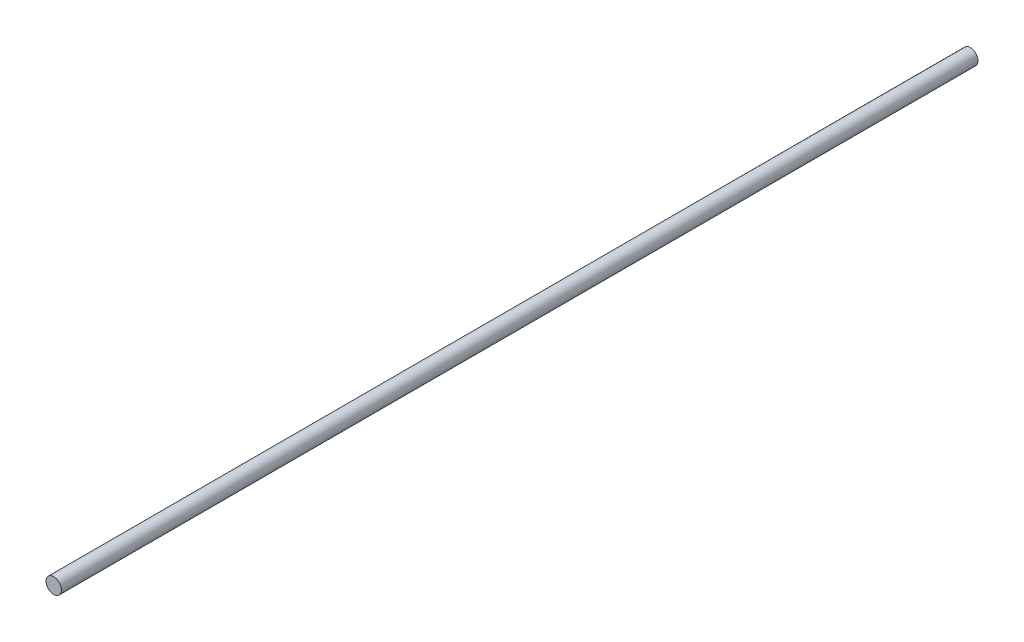
ISO-10303-21;
HEADER;
FILE_DESCRIPTION(('STEP AP214'),'2;1');
FILE_NAME('part.step','',(''),(''),'','','');
FILE_SCHEMA(('AUTOMOTIVE_DESIGN { 1 0 10303 214 1 1 1 1 }'));
ENDSEC;
DATA;
#1=APPLICATION_CONTEXT('core data for automotive mechanical design processes');
#2=APPLICATION_PROTOCOL_DEFINITION('international standard','automotive_design',2000,#1);
#3=PRODUCT_CONTEXT('',#1,'mechanical');
#4=PRODUCT('Part','Part','',(#3));
#5=PRODUCT_RELATED_PRODUCT_CATEGORY('part','',(#4));
#6=PRODUCT_DEFINITION_FORMATION('','',#4);
#7=PRODUCT_DEFINITION_CONTEXT('part definition',#1,'design');
#8=PRODUCT_DEFINITION('design','',#6,#7);
#9=PRODUCT_DEFINITION_SHAPE('','',#8);
#10=(LENGTH_UNIT() NAMED_UNIT(*) SI_UNIT(.MILLI.,.METRE.));
#11=(NAMED_UNIT(*) PLANE_ANGLE_UNIT() SI_UNIT($,.RADIAN.));
#12=(NAMED_UNIT(*) SI_UNIT($,.STERADIAN.) SOLID_ANGLE_UNIT());
#13=UNCERTAINTY_MEASURE_WITH_UNIT(LENGTH_MEASURE(1.E-05),#10,'distance_accuracy_value','');
#14=(GEOMETRIC_REPRESENTATION_CONTEXT(3) GLOBAL_UNCERTAINTY_ASSIGNED_CONTEXT((#13)) GLOBAL_UNIT_ASSIGNED_CONTEXT((#10,
#11,#12)) REPRESENTATION_CONTEXT('',''));
#15=CARTESIAN_POINT('',(0.,0.,0.));
#16=DIRECTION('',(0.,0.,1.));
#17=DIRECTION('',(1.,0.,0.));
#18=AXIS2_PLACEMENT_3D('',#15,#16,#17);
#19=CARTESIAN_POINT('',(0.,0.,238.));
#20=DIRECTION('',(0.,0.,-1.));
#21=DIRECTION('',(-1.,0.,0.));
#22=AXIS2_PLACEMENT_3D('',#19,#20,#21);
#23=CYLINDRICAL_SURFACE('',#22,2.);
#24=CARTESIAN_POINT('',(0.,0.,238.));
#25=DIRECTION('',(0.,0.,1.));
#26=DIRECTION('',(1.,0.,0.));
#27=AXIS2_PLACEMENT_3D('',#24,#25,#26);
#28=CIRCLE('',#27,2.);
#29=CARTESIAN_POINT('',(2.,0.,238.));
#30=VERTEX_POINT('',#29);
#31=EDGE_CURVE('E10',#30,#30,#28,.T.);
#32=ORIENTED_EDGE('',*,*,#31,.F.);
#33=EDGE_LOOP('',(#32));
#34=FACE_BOUND('',#33,.T.);
#35=CARTESIAN_POINT('',(0.,0.,0.));
#36=DIRECTION('',(0.,0.,1.));
#37=DIRECTION('',(1.,0.,0.));
#38=AXIS2_PLACEMENT_3D('',#35,#36,#37);
#39=CIRCLE('',#38,2.);
#40=CARTESIAN_POINT('',(2.,0.,0.));
#41=VERTEX_POINT('',#40);
#42=EDGE_CURVE('E34',#41,#41,#39,.T.);
#43=ORIENTED_EDGE('',*,*,#42,.T.);
#44=EDGE_LOOP('',(#43));
#45=FACE_BOUND('',#44,.T.);
#46=ADVANCED_FACE('F31',(#34,#45),#23,.T.);
#47=CARTESIAN_POINT('',(0.,0.,238.));
#48=DIRECTION('',(0.,0.,1.));
#49=DIRECTION('',(1.,0.,0.));
#50=AXIS2_PLACEMENT_3D('',#47,#48,#49);
#51=PLANE('',#50);
#52=ORIENTED_EDGE('',*,*,#31,.T.);
#53=EDGE_LOOP('',(#52));
#54=FACE_BOUND('',#53,.T.);
#55=ADVANCED_FACE('F46',(#54),#51,.T.);
#56=CARTESIAN_POINT('',(0.,0.,0.));
#57=DIRECTION('',(0.,0.,1.));
#58=DIRECTION('',(1.,0.,0.));
#59=AXIS2_PLACEMENT_3D('',#56,#57,#58);
#60=PLANE('',#59);
#61=ORIENTED_EDGE('',*,*,#42,.F.);
#62=EDGE_LOOP('',(#61));
#63=FACE_BOUND('',#62,.T.);
#64=ADVANCED_FACE('F44',(#63),#60,.F.);
#65=CLOSED_SHELL('',(#46,#55,#64));
#66=MANIFOLD_SOLID_BREP('B2',#65);
#67=ADVANCED_BREP_SHAPE_REPRESENTATION('',(#18,#66),#14);
#68=SHAPE_DEFINITION_REPRESENTATION(#9,#67);
ENDSEC;
END-ISO-10303-21;
